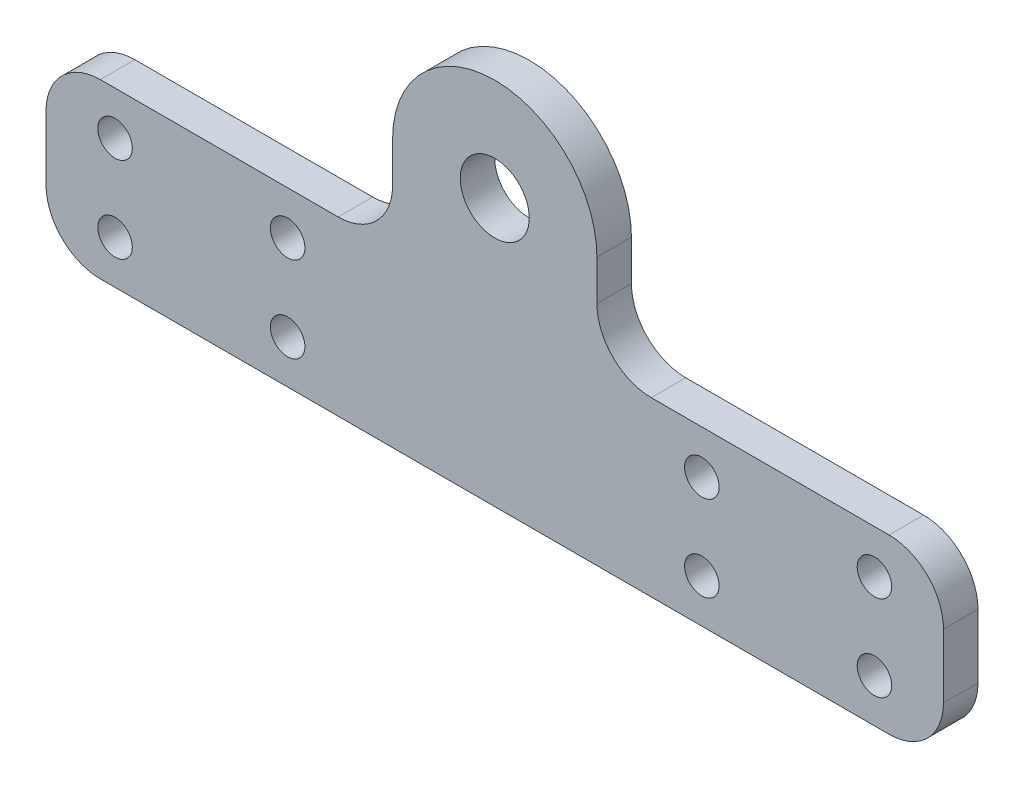
ISO-10303-21;
HEADER;
FILE_DESCRIPTION(('STEP AP214'),'2;1');
FILE_NAME('part.step','',(''),(''),'','','');
FILE_SCHEMA(('AUTOMOTIVE_DESIGN { 1 0 10303 214 1 1 1 1 }'));
ENDSEC;
DATA;
#1=APPLICATION_CONTEXT('core data for automotive mechanical design processes');
#2=APPLICATION_PROTOCOL_DEFINITION('international standard','automotive_design',2000,#1);
#3=PRODUCT_CONTEXT('',#1,'mechanical');
#4=PRODUCT('Part','Part','',(#3));
#5=PRODUCT_RELATED_PRODUCT_CATEGORY('part','',(#4));
#6=PRODUCT_DEFINITION_FORMATION('','',#4);
#7=PRODUCT_DEFINITION_CONTEXT('part definition',#1,'design');
#8=PRODUCT_DEFINITION('design','',#6,#7);
#9=PRODUCT_DEFINITION_SHAPE('','',#8);
#10=(LENGTH_UNIT() NAMED_UNIT(*) SI_UNIT(.MILLI.,.METRE.));
#11=(NAMED_UNIT(*) PLANE_ANGLE_UNIT() SI_UNIT($,.RADIAN.));
#12=(NAMED_UNIT(*) SI_UNIT($,.STERADIAN.) SOLID_ANGLE_UNIT());
#13=UNCERTAINTY_MEASURE_WITH_UNIT(LENGTH_MEASURE(1.E-05),#10,'distance_accuracy_value','');
#14=(GEOMETRIC_REPRESENTATION_CONTEXT(3) GLOBAL_UNCERTAINTY_ASSIGNED_CONTEXT((#13)) GLOBAL_UNIT_ASSIGNED_CONTEXT((#10,
#11,#12)) REPRESENTATION_CONTEXT('',''));
#15=CARTESIAN_POINT('',(0.,0.,0.));
#16=DIRECTION('',(0.,0.,1.));
#17=DIRECTION('',(1.,0.,0.));
#18=AXIS2_PLACEMENT_3D('',#15,#16,#17);
#19=CARTESIAN_POINT('',(14.398,-3.7,3.175));
#20=DIRECTION('',(0.,0.,-1.));
#21=DIRECTION('',(-1.,0.,0.));
#22=AXIS2_PLACEMENT_3D('',#19,#20,#21);
#23=PLANE('',#22);
#24=DIRECTION('',(1.,0.,0.));
#25=VECTOR('',#24,1.);
#26=CARTESIAN_POINT('',(-41.275,-24.575,3.175));
#27=LINE('',#26,#25);
#28=CARTESIAN_POINT('',(-36.275,-24.575,3.175));
#29=VERTEX_POINT('',#28);
#30=CARTESIAN_POINT('',(36.275,-24.575,3.175));
#31=VERTEX_POINT('',#30);
#32=EDGE_CURVE('E246',#29,#31,#27,.T.);
#33=ORIENTED_EDGE('',*,*,#32,.T.);
#34=CARTESIAN_POINT('',(36.275,-19.575,3.175));
#35=DIRECTION('',(0.,0.,-1.));
#36=DIRECTION('',(-1.,0.,0.));
#37=AXIS2_PLACEMENT_3D('',#34,#35,#36);
#38=CIRCLE('',#37,5.);
#39=CARTESIAN_POINT('',(41.275,-19.575,3.175));
#40=VERTEX_POINT('',#39);
#41=EDGE_CURVE('E229',#31,#40,#38,.F.);
#42=ORIENTED_EDGE('',*,*,#41,.T.);
#43=DIRECTION('',(0.,1.,0.));
#44=VECTOR('',#43,1.);
#45=CARTESIAN_POINT('',(41.275,-8.7,3.175));
#46=LINE('',#45,#44);
#47=CARTESIAN_POINT('',(41.275,-13.7,3.175));
#48=VERTEX_POINT('',#47);
#49=EDGE_CURVE('E142',#40,#48,#46,.T.);
#50=ORIENTED_EDGE('',*,*,#49,.T.);
#51=CARTESIAN_POINT('',(36.275,-13.7,3.175));
#52=DIRECTION('',(0.,0.,-1.));
#53=DIRECTION('',(-1.,0.,0.));
#54=AXIS2_PLACEMENT_3D('',#51,#52,#53);
#55=CIRCLE('',#54,5.);
#56=CARTESIAN_POINT('',(36.275,-8.7,3.175));
#57=VERTEX_POINT('',#56);
#58=EDGE_CURVE('E54',#48,#57,#55,.F.);
#59=ORIENTED_EDGE('',*,*,#58,.T.);
#60=DIRECTION('',(-1.,0.,0.));
#61=VECTOR('',#60,1.);
#62=CARTESIAN_POINT('',(14.398,-8.7,3.175));
#63=LINE('',#62,#61);
#64=CARTESIAN_POINT('',(14.398,-8.7,3.175));
#65=VERTEX_POINT('',#64);
#66=EDGE_CURVE('E132',#57,#65,#63,.T.);
#67=ORIENTED_EDGE('',*,*,#66,.T.);
#68=CARTESIAN_POINT('',(14.398,-3.7,3.175));
#69=DIRECTION('',(0.,0.,-1.));
#70=DIRECTION('',(-1.,0.,0.));
#71=AXIS2_PLACEMENT_3D('',#68,#69,#70);
#72=CIRCLE('',#71,5.);
#73=CARTESIAN_POINT('',(9.398,-3.7,3.175));
#74=VERTEX_POINT('',#73);
#75=EDGE_CURVE('E137',#65,#74,#72,.T.);
#76=ORIENTED_EDGE('',*,*,#75,.T.);
#77=DIRECTION('',(0.,1.,0.));
#78=VECTOR('',#77,1.);
#79=CARTESIAN_POINT('',(9.398,-3.7,3.175));
#80=LINE('',#79,#78);
#81=CARTESIAN_POINT('',(9.398,0.,3.175));
#82=VERTEX_POINT('',#81);
#83=EDGE_CURVE('E157',#74,#82,#80,.T.);
#84=ORIENTED_EDGE('',*,*,#83,.T.);
#85=CARTESIAN_POINT('',(0.,0.,3.175));
#86=DIRECTION('',(0.,0.,1.));
#87=DIRECTION('',(-1.,0.,0.));
#88=AXIS2_PLACEMENT_3D('',#85,#86,#87);
#89=CIRCLE('',#88,9.398);
#90=CARTESIAN_POINT('',(-9.398,0.,3.175));
#91=VERTEX_POINT('',#90);
#92=EDGE_CURVE('E159',#82,#91,#89,.T.);
#93=ORIENTED_EDGE('',*,*,#92,.T.);
#94=DIRECTION('',(0.,-1.,0.));
#95=VECTOR('',#94,1.);
#96=CARTESIAN_POINT('',(-9.398,-3.7,3.175));
#97=LINE('',#96,#95);
#98=CARTESIAN_POINT('',(-9.398,-3.7,3.175));
#99=VERTEX_POINT('',#98);
#100=EDGE_CURVE('E164',#91,#99,#97,.T.);
#101=ORIENTED_EDGE('',*,*,#100,.T.);
#102=CARTESIAN_POINT('',(-14.398,-3.7,3.175));
#103=DIRECTION('',(0.,0.,-1.));
#104=DIRECTION('',(1.,0.,0.));
#105=AXIS2_PLACEMENT_3D('',#102,#103,#104);
#106=CIRCLE('',#105,5.);
#107=CARTESIAN_POINT('',(-14.398,-8.7,3.175));
#108=VERTEX_POINT('',#107);
#109=EDGE_CURVE('E166',#99,#108,#106,.T.);
#110=ORIENTED_EDGE('',*,*,#109,.T.);
#111=DIRECTION('',(-1.,0.,0.));
#112=VECTOR('',#111,1.);
#113=CARTESIAN_POINT('',(-41.275,-8.7,3.175));
#114=LINE('',#113,#112);
#115=CARTESIAN_POINT('',(-36.275,-8.7,3.175));
#116=VERTEX_POINT('',#115);
#117=EDGE_CURVE('E168',#108,#116,#114,.T.);
#118=ORIENTED_EDGE('',*,*,#117,.T.);
#119=CARTESIAN_POINT('',(-36.275,-13.7,3.175));
#120=DIRECTION('',(0.,0.,-1.));
#121=DIRECTION('',(-1.,0.,0.));
#122=AXIS2_PLACEMENT_3D('',#119,#120,#121);
#123=CIRCLE('',#122,5.);
#124=CARTESIAN_POINT('',(-41.275,-13.7,3.175));
#125=VERTEX_POINT('',#124);
#126=EDGE_CURVE('E224',#116,#125,#123,.F.);
#127=ORIENTED_EDGE('',*,*,#126,.T.);
#128=DIRECTION('',(0.,-1.,0.));
#129=VECTOR('',#128,1.);
#130=CARTESIAN_POINT('',(-41.275,-8.7,3.175));
#131=LINE('',#130,#129);
#132=CARTESIAN_POINT('',(-41.275,-19.575,3.175));
#133=VERTEX_POINT('',#132);
#134=EDGE_CURVE('E194',#125,#133,#131,.T.);
#135=ORIENTED_EDGE('',*,*,#134,.T.);
#136=CARTESIAN_POINT('',(-36.275,-19.575,3.175));
#137=DIRECTION('',(0.,0.,-1.));
#138=DIRECTION('',(-1.,0.,0.));
#139=AXIS2_PLACEMENT_3D('',#136,#137,#138);
#140=CIRCLE('',#139,5.);
#141=EDGE_CURVE('E226',#133,#29,#140,.F.);
#142=ORIENTED_EDGE('',*,*,#141,.T.);
#143=EDGE_LOOP('',(#33,#42,#50,#59,#67,#76,#84,#93,#101,#110,#118,#127,#135,#142));
#144=FACE_BOUND('',#143,.T.);
#145=CARTESIAN_POINT('',(0.,0.,3.175));
#146=DIRECTION('',(0.,0.,1.));
#147=DIRECTION('',(1.,0.,0.));
#148=AXIS2_PLACEMENT_3D('',#145,#146,#147);
#149=CIRCLE('',#148,3.175);
#150=CARTESIAN_POINT('',(3.175,0.,3.175));
#151=VERTEX_POINT('',#150);
#152=EDGE_CURVE('E175',#151,#151,#149,.T.);
#153=ORIENTED_EDGE('',*,*,#152,.F.);
#154=EDGE_LOOP('',(#153));
#155=FACE_BOUND('',#154,.T.);
#156=CARTESIAN_POINT('',(-34.925,-12.7,3.175));
#157=DIRECTION('',(0.,0.,1.));
#158=DIRECTION('',(1.,0.,0.));
#159=AXIS2_PLACEMENT_3D('',#156,#157,#158);
#160=CIRCLE('',#159,1.5875);
#161=CARTESIAN_POINT('',(-33.3375,-12.7,3.175));
#162=VERTEX_POINT('',#161);
#163=EDGE_CURVE('E271',#162,#162,#160,.T.);
#164=ORIENTED_EDGE('',*,*,#163,.F.);
#165=EDGE_LOOP('',(#164));
#166=FACE_BOUND('',#165,.T.);
#167=CARTESIAN_POINT('',(-34.925,-20.575,3.175));
#168=DIRECTION('',(0.,0.,1.));
#169=DIRECTION('',(1.,0.,0.));
#170=AXIS2_PLACEMENT_3D('',#167,#168,#169);
#171=CIRCLE('',#170,1.5875);
#172=CARTESIAN_POINT('',(-33.3375,-20.575,3.175));
#173=VERTEX_POINT('',#172);
#174=EDGE_CURVE('E277',#173,#173,#171,.T.);
#175=ORIENTED_EDGE('',*,*,#174,.F.);
#176=EDGE_LOOP('',(#175));
#177=FACE_BOUND('',#176,.T.);
#178=CARTESIAN_POINT('',(-19.05,-12.7,3.175));
#179=DIRECTION('',(0.,0.,1.));
#180=DIRECTION('',(1.,0.,0.));
#181=AXIS2_PLACEMENT_3D('',#178,#179,#180);
#182=CIRCLE('',#181,1.5875);
#183=CARTESIAN_POINT('',(-17.4625,-12.7,3.175));
#184=VERTEX_POINT('',#183);
#185=EDGE_CURVE('E283',#184,#184,#182,.T.);
#186=ORIENTED_EDGE('',*,*,#185,.F.);
#187=EDGE_LOOP('',(#186));
#188=FACE_BOUND('',#187,.T.);
#189=CARTESIAN_POINT('',(-19.05,-20.575,3.175));
#190=DIRECTION('',(0.,0.,1.));
#191=DIRECTION('',(1.,0.,0.));
#192=AXIS2_PLACEMENT_3D('',#189,#190,#191);
#193=CIRCLE('',#192,1.5875);
#194=CARTESIAN_POINT('',(-17.4625,-20.575,3.175));
#195=VERTEX_POINT('',#194);
#196=EDGE_CURVE('E289',#195,#195,#193,.T.);
#197=ORIENTED_EDGE('',*,*,#196,.F.);
#198=EDGE_LOOP('',(#197));
#199=FACE_BOUND('',#198,.T.);
#200=CARTESIAN_POINT('',(19.05,-20.575,3.175));
#201=DIRECTION('',(0.,0.,1.));
#202=DIRECTION('',(-1.,0.,0.));
#203=AXIS2_PLACEMENT_3D('',#200,#201,#202);
#204=CIRCLE('',#203,1.5875);
#205=CARTESIAN_POINT('',(17.4625,-20.575,3.175));
#206=VERTEX_POINT('',#205);
#207=EDGE_CURVE('E295',#206,#206,#204,.T.);
#208=ORIENTED_EDGE('',*,*,#207,.F.);
#209=EDGE_LOOP('',(#208));
#210=FACE_BOUND('',#209,.T.);
#211=CARTESIAN_POINT('',(19.05,-12.7,3.175));
#212=DIRECTION('',(0.,0.,1.));
#213=DIRECTION('',(-1.,0.,0.));
#214=AXIS2_PLACEMENT_3D('',#211,#212,#213);
#215=CIRCLE('',#214,1.5875);
#216=CARTESIAN_POINT('',(17.4625,-12.7,3.175));
#217=VERTEX_POINT('',#216);
#218=EDGE_CURVE('E301',#217,#217,#215,.T.);
#219=ORIENTED_EDGE('',*,*,#218,.F.);
#220=EDGE_LOOP('',(#219));
#221=FACE_BOUND('',#220,.T.);
#222=CARTESIAN_POINT('',(34.925,-20.575,3.175));
#223=DIRECTION('',(0.,0.,1.));
#224=DIRECTION('',(-1.,0.,0.));
#225=AXIS2_PLACEMENT_3D('',#222,#223,#224);
#226=CIRCLE('',#225,1.5875);
#227=CARTESIAN_POINT('',(33.3375,-20.575,3.175));
#228=VERTEX_POINT('',#227);
#229=EDGE_CURVE('E307',#228,#228,#226,.T.);
#230=ORIENTED_EDGE('',*,*,#229,.F.);
#231=EDGE_LOOP('',(#230));
#232=FACE_BOUND('',#231,.T.);
#233=CARTESIAN_POINT('',(34.925,-12.7,3.175));
#234=DIRECTION('',(0.,0.,1.));
#235=DIRECTION('',(-1.,0.,0.));
#236=AXIS2_PLACEMENT_3D('',#233,#234,#235);
#237=CIRCLE('',#236,1.5875);
#238=CARTESIAN_POINT('',(33.3375,-12.7,3.175));
#239=VERTEX_POINT('',#238);
#240=EDGE_CURVE('E313',#239,#239,#237,.T.);
#241=ORIENTED_EDGE('',*,*,#240,.F.);
#242=EDGE_LOOP('',(#241));
#243=FACE_BOUND('',#242,.T.);
#244=ADVANCED_FACE('F33',(#144,#155,#166,#177,#188,#199,#210,#221,#232,#243),#23,.F.);
#245=CARTESIAN_POINT('',(14.398,-3.7,0.));
#246=DIRECTION('',(0.,0.,-1.));
#247=DIRECTION('',(-1.,0.,0.));
#248=AXIS2_PLACEMENT_3D('',#245,#246,#247);
#249=PLANE('',#248);
#250=CARTESIAN_POINT('',(34.925,-20.575,0.));
#251=DIRECTION('',(0.,0.,1.));
#252=DIRECTION('',(-1.,0.,0.));
#253=AXIS2_PLACEMENT_3D('',#250,#251,#252);
#254=CIRCLE('',#253,1.5875);
#255=CARTESIAN_POINT('',(33.3375,-20.575,0.));
#256=VERTEX_POINT('',#255);
#257=EDGE_CURVE('E310',#256,#256,#254,.T.);
#258=ORIENTED_EDGE('',*,*,#257,.T.);
#259=EDGE_LOOP('',(#258));
#260=FACE_BOUND('',#259,.T.);
#261=CARTESIAN_POINT('',(19.05,-20.575,0.));
#262=DIRECTION('',(0.,0.,1.));
#263=DIRECTION('',(-1.,0.,0.));
#264=AXIS2_PLACEMENT_3D('',#261,#262,#263);
#265=CIRCLE('',#264,1.5875);
#266=CARTESIAN_POINT('',(17.4625,-20.575,0.));
#267=VERTEX_POINT('',#266);
#268=EDGE_CURVE('E298',#267,#267,#265,.T.);
#269=ORIENTED_EDGE('',*,*,#268,.T.);
#270=EDGE_LOOP('',(#269));
#271=FACE_BOUND('',#270,.T.);
#272=CARTESIAN_POINT('',(-19.05,-12.7,0.));
#273=DIRECTION('',(0.,0.,1.));
#274=DIRECTION('',(1.,0.,0.));
#275=AXIS2_PLACEMENT_3D('',#272,#273,#274);
#276=CIRCLE('',#275,1.5875);
#277=CARTESIAN_POINT('',(-17.4625,-12.7,0.));
#278=VERTEX_POINT('',#277);
#279=EDGE_CURVE('E286',#278,#278,#276,.T.);
#280=ORIENTED_EDGE('',*,*,#279,.T.);
#281=EDGE_LOOP('',(#280));
#282=FACE_BOUND('',#281,.T.);
#283=CARTESIAN_POINT('',(-34.925,-12.7,0.));
#284=DIRECTION('',(0.,0.,1.));
#285=DIRECTION('',(1.,0.,0.));
#286=AXIS2_PLACEMENT_3D('',#283,#284,#285);
#287=CIRCLE('',#286,1.5875);
#288=CARTESIAN_POINT('',(-33.3375,-12.7,0.));
#289=VERTEX_POINT('',#288);
#290=EDGE_CURVE('E274',#289,#289,#287,.T.);
#291=ORIENTED_EDGE('',*,*,#290,.T.);
#292=EDGE_LOOP('',(#291));
#293=FACE_BOUND('',#292,.T.);
#294=DIRECTION('',(0.,1.,0.));
#295=VECTOR('',#294,1.);
#296=CARTESIAN_POINT('',(41.275,-8.7,0.));
#297=LINE('',#296,#295);
#298=CARTESIAN_POINT('',(41.275,-19.575,0.));
#299=VERTEX_POINT('',#298);
#300=CARTESIAN_POINT('',(41.275,-13.7,0.));
#301=VERTEX_POINT('',#300);
#302=EDGE_CURVE('E178',#299,#301,#297,.T.);
#303=ORIENTED_EDGE('',*,*,#302,.F.);
#304=CARTESIAN_POINT('',(36.275,-19.575,0.));
#305=DIRECTION('',(0.,0.,-1.));
#306=DIRECTION('',(-1.,0.,0.));
#307=AXIS2_PLACEMENT_3D('',#304,#305,#306);
#308=CIRCLE('',#307,5.);
#309=CARTESIAN_POINT('',(36.275,-24.575,0.));
#310=VERTEX_POINT('',#309);
#311=EDGE_CURVE('E217',#299,#310,#308,.T.);
#312=ORIENTED_EDGE('',*,*,#311,.T.);
#313=DIRECTION('',(1.,0.,0.));
#314=VECTOR('',#313,1.);
#315=CARTESIAN_POINT('',(-41.275,-24.575,0.));
#316=LINE('',#315,#314);
#317=CARTESIAN_POINT('',(-36.275,-24.575,0.));
#318=VERTEX_POINT('',#317);
#319=EDGE_CURVE('E174',#318,#310,#316,.T.);
#320=ORIENTED_EDGE('',*,*,#319,.F.);
#321=CARTESIAN_POINT('',(-36.275,-19.575,0.));
#322=DIRECTION('',(0.,0.,-1.));
#323=DIRECTION('',(-1.,0.,0.));
#324=AXIS2_PLACEMENT_3D('',#321,#322,#323);
#325=CIRCLE('',#324,5.);
#326=CARTESIAN_POINT('',(-41.275,-19.575,0.));
#327=VERTEX_POINT('',#326);
#328=EDGE_CURVE('E213',#318,#327,#325,.T.);
#329=ORIENTED_EDGE('',*,*,#328,.T.);
#330=DIRECTION('',(0.,-1.,0.));
#331=VECTOR('',#330,1.);
#332=CARTESIAN_POINT('',(-41.275,-8.7,0.));
#333=LINE('',#332,#331);
#334=CARTESIAN_POINT('',(-41.275,-13.7,0.));
#335=VERTEX_POINT('',#334);
#336=EDGE_CURVE('E171',#335,#327,#333,.T.);
#337=ORIENTED_EDGE('',*,*,#336,.F.);
#338=CARTESIAN_POINT('',(-36.275,-13.7,0.));
#339=DIRECTION('',(0.,0.,-1.));
#340=DIRECTION('',(-1.,0.,0.));
#341=AXIS2_PLACEMENT_3D('',#338,#339,#340);
#342=CIRCLE('',#341,5.);
#343=CARTESIAN_POINT('',(-36.275,-8.7,0.));
#344=VERTEX_POINT('',#343);
#345=EDGE_CURVE('E211',#335,#344,#342,.T.);
#346=ORIENTED_EDGE('',*,*,#345,.T.);
#347=DIRECTION('',(-1.,0.,0.));
#348=VECTOR('',#347,1.);
#349=CARTESIAN_POINT('',(-41.275,-8.7,0.));
#350=LINE('',#349,#348);
#351=CARTESIAN_POINT('',(-14.398,-8.7,0.));
#352=VERTEX_POINT('',#351);
#353=EDGE_CURVE('E192',#352,#344,#350,.T.);
#354=ORIENTED_EDGE('',*,*,#353,.F.);
#355=CARTESIAN_POINT('',(-14.398,-3.7,0.));
#356=DIRECTION('',(0.,0.,-1.));
#357=DIRECTION('',(1.,0.,0.));
#358=AXIS2_PLACEMENT_3D('',#355,#356,#357);
#359=CIRCLE('',#358,5.);
#360=CARTESIAN_POINT('',(-9.398,-3.7,0.));
#361=VERTEX_POINT('',#360);
#362=EDGE_CURVE('E190',#361,#352,#359,.T.);
#363=ORIENTED_EDGE('',*,*,#362,.F.);
#364=DIRECTION('',(0.,-1.,0.));
#365=VECTOR('',#364,1.);
#366=CARTESIAN_POINT('',(-9.398,-3.7,0.));
#367=LINE('',#366,#365);
#368=CARTESIAN_POINT('',(-9.398,0.,0.));
#369=VERTEX_POINT('',#368);
#370=EDGE_CURVE('E188',#369,#361,#367,.T.);
#371=ORIENTED_EDGE('',*,*,#370,.F.);
#372=CARTESIAN_POINT('',(0.,0.,0.));
#373=DIRECTION('',(0.,0.,1.));
#374=DIRECTION('',(-1.,0.,0.));
#375=AXIS2_PLACEMENT_3D('',#372,#373,#374);
#376=CIRCLE('',#375,9.398);
#377=CARTESIAN_POINT('',(9.398,0.,0.));
#378=VERTEX_POINT('',#377);
#379=EDGE_CURVE('E186',#378,#369,#376,.T.);
#380=ORIENTED_EDGE('',*,*,#379,.F.);
#381=DIRECTION('',(0.,1.,0.));
#382=VECTOR('',#381,1.);
#383=CARTESIAN_POINT('',(9.398,-3.7,0.));
#384=LINE('',#383,#382);
#385=CARTESIAN_POINT('',(9.398,-3.7,0.));
#386=VERTEX_POINT('',#385);
#387=EDGE_CURVE('E184',#386,#378,#384,.T.);
#388=ORIENTED_EDGE('',*,*,#387,.F.);
#389=CARTESIAN_POINT('',(14.398,-3.7,0.));
#390=DIRECTION('',(0.,0.,-1.));
#391=DIRECTION('',(-1.,0.,0.));
#392=AXIS2_PLACEMENT_3D('',#389,#390,#391);
#393=CIRCLE('',#392,5.);
#394=CARTESIAN_POINT('',(14.398,-8.7,0.));
#395=VERTEX_POINT('',#394);
#396=EDGE_CURVE('E182',#395,#386,#393,.T.);
#397=ORIENTED_EDGE('',*,*,#396,.F.);
#398=DIRECTION('',(-1.,0.,0.));
#399=VECTOR('',#398,1.);
#400=CARTESIAN_POINT('',(14.398,-8.7,0.));
#401=LINE('',#400,#399);
#402=CARTESIAN_POINT('',(36.275,-8.7,0.));
#403=VERTEX_POINT('',#402);
#404=EDGE_CURVE('E148',#403,#395,#401,.T.);
#405=ORIENTED_EDGE('',*,*,#404,.F.);
#406=CARTESIAN_POINT('',(36.275,-13.7,0.));
#407=DIRECTION('',(0.,0.,-1.));
#408=DIRECTION('',(-1.,0.,0.));
#409=AXIS2_PLACEMENT_3D('',#406,#407,#408);
#410=CIRCLE('',#409,5.);
#411=EDGE_CURVE('E215',#403,#301,#410,.T.);
#412=ORIENTED_EDGE('',*,*,#411,.T.);
#413=EDGE_LOOP('',(#303,#312,#320,#329,#337,#346,#354,#363,#371,#380,#388,#397,#405,#412));
#414=FACE_BOUND('',#413,.T.);
#415=CARTESIAN_POINT('',(0.,0.,0.));
#416=DIRECTION('',(0.,0.,1.));
#417=DIRECTION('',(1.,0.,0.));
#418=AXIS2_PLACEMENT_3D('',#415,#416,#417);
#419=CIRCLE('',#418,3.175);
#420=CARTESIAN_POINT('',(3.175,0.,0.));
#421=VERTEX_POINT('',#420);
#422=EDGE_CURVE('E268',#421,#421,#419,.T.);
#423=ORIENTED_EDGE('',*,*,#422,.T.);
#424=EDGE_LOOP('',(#423));
#425=FACE_BOUND('',#424,.T.);
#426=CARTESIAN_POINT('',(-34.925,-20.575,0.));
#427=DIRECTION('',(0.,0.,1.));
#428=DIRECTION('',(1.,0.,0.));
#429=AXIS2_PLACEMENT_3D('',#426,#427,#428);
#430=CIRCLE('',#429,1.5875);
#431=CARTESIAN_POINT('',(-33.3375,-20.575,0.));
#432=VERTEX_POINT('',#431);
#433=EDGE_CURVE('E280',#432,#432,#430,.T.);
#434=ORIENTED_EDGE('',*,*,#433,.T.);
#435=EDGE_LOOP('',(#434));
#436=FACE_BOUND('',#435,.T.);
#437=CARTESIAN_POINT('',(-19.05,-20.575,0.));
#438=DIRECTION('',(0.,0.,1.));
#439=DIRECTION('',(1.,0.,0.));
#440=AXIS2_PLACEMENT_3D('',#437,#438,#439);
#441=CIRCLE('',#440,1.5875);
#442=CARTESIAN_POINT('',(-17.4625,-20.575,0.));
#443=VERTEX_POINT('',#442);
#444=EDGE_CURVE('E292',#443,#443,#441,.T.);
#445=ORIENTED_EDGE('',*,*,#444,.T.);
#446=EDGE_LOOP('',(#445));
#447=FACE_BOUND('',#446,.T.);
#448=CARTESIAN_POINT('',(19.05,-12.7,0.));
#449=DIRECTION('',(0.,0.,1.));
#450=DIRECTION('',(-1.,0.,0.));
#451=AXIS2_PLACEMENT_3D('',#448,#449,#450);
#452=CIRCLE('',#451,1.5875);
#453=CARTESIAN_POINT('',(17.4625,-12.7,0.));
#454=VERTEX_POINT('',#453);
#455=EDGE_CURVE('E304',#454,#454,#452,.T.);
#456=ORIENTED_EDGE('',*,*,#455,.T.);
#457=EDGE_LOOP('',(#456));
#458=FACE_BOUND('',#457,.T.);
#459=CARTESIAN_POINT('',(34.925,-12.7,0.));
#460=DIRECTION('',(0.,0.,1.));
#461=DIRECTION('',(-1.,0.,0.));
#462=AXIS2_PLACEMENT_3D('',#459,#460,#461);
#463=CIRCLE('',#462,1.5875);
#464=CARTESIAN_POINT('',(33.3375,-12.7,0.));
#465=VERTEX_POINT('',#464);
#466=EDGE_CURVE('E316',#465,#465,#463,.T.);
#467=ORIENTED_EDGE('',*,*,#466,.T.);
#468=EDGE_LOOP('',(#467));
#469=FACE_BOUND('',#468,.T.);
#470=ADVANCED_FACE('F256',(#260,#271,#282,#293,#414,#425,#436,#447,#458,#469),#249,.T.);
#471=CARTESIAN_POINT('',(-41.275,-8.7,3.175));
#472=DIRECTION('',(1.,0.,0.));
#473=DIRECTION('',(0.,0.,-1.));
#474=AXIS2_PLACEMENT_3D('',#471,#472,#473);
#475=PLANE('',#474);
#476=ORIENTED_EDGE('',*,*,#336,.T.);
#477=DIRECTION('',(0.,0.,-1.));
#478=VECTOR('',#477,1.);
#479=CARTESIAN_POINT('',(-41.275,-19.575,3.175));
#480=LINE('',#479,#478);
#481=EDGE_CURVE('E41',#327,#133,#480,.F.);
#482=ORIENTED_EDGE('',*,*,#481,.T.);
#483=ORIENTED_EDGE('',*,*,#134,.F.);
#484=DIRECTION('',(0.,0.,-1.));
#485=VECTOR('',#484,1.);
#486=CARTESIAN_POINT('',(-41.275,-13.7,3.175));
#487=LINE('',#486,#485);
#488=EDGE_CURVE('E233',#125,#335,#487,.T.);
#489=ORIENTED_EDGE('',*,*,#488,.T.);
#490=EDGE_LOOP('',(#476,#482,#483,#489));
#491=FACE_BOUND('',#490,.T.);
#492=ADVANCED_FACE('F239',(#491),#475,.F.);
#493=CARTESIAN_POINT('',(-41.275,-24.575,3.175));
#494=DIRECTION('',(0.,1.,0.));
#495=DIRECTION('',(0.,0.,1.));
#496=AXIS2_PLACEMENT_3D('',#493,#494,#495);
#497=PLANE('',#496);
#498=ORIENTED_EDGE('',*,*,#319,.T.);
#499=DIRECTION('',(0.,0.,-1.));
#500=VECTOR('',#499,1.);
#501=CARTESIAN_POINT('',(36.275,-24.575,3.175));
#502=LINE('',#501,#500);
#503=EDGE_CURVE('E222',#310,#31,#502,.F.);
#504=ORIENTED_EDGE('',*,*,#503,.T.);
#505=ORIENTED_EDGE('',*,*,#32,.F.);
#506=DIRECTION('',(0.,0.,-1.));
#507=VECTOR('',#506,1.);
#508=CARTESIAN_POINT('',(-36.275,-24.575,3.175));
#509=LINE('',#508,#507);
#510=EDGE_CURVE('E219',#29,#318,#509,.T.);
#511=ORIENTED_EDGE('',*,*,#510,.T.);
#512=EDGE_LOOP('',(#498,#504,#505,#511));
#513=FACE_BOUND('',#512,.T.);
#514=ADVANCED_FACE('F252',(#513),#497,.F.);
#515=CARTESIAN_POINT('',(41.275,-8.7,3.175));
#516=DIRECTION('',(-1.,0.,0.));
#517=DIRECTION('',(0.,0.,1.));
#518=AXIS2_PLACEMENT_3D('',#515,#516,#517);
#519=PLANE('',#518);
#520=ORIENTED_EDGE('',*,*,#49,.F.);
#521=DIRECTION('',(0.,0.,-1.));
#522=VECTOR('',#521,1.);
#523=CARTESIAN_POINT('',(41.275,-19.575,3.175));
#524=LINE('',#523,#522);
#525=EDGE_CURVE('E208',#40,#299,#524,.T.);
#526=ORIENTED_EDGE('',*,*,#525,.T.);
#527=ORIENTED_EDGE('',*,*,#302,.T.);
#528=DIRECTION('',(0.,0.,-1.));
#529=VECTOR('',#528,1.);
#530=CARTESIAN_POINT('',(41.275,-13.7,3.175));
#531=LINE('',#530,#529);
#532=EDGE_CURVE('E151',#301,#48,#531,.F.);
#533=ORIENTED_EDGE('',*,*,#532,.T.);
#534=EDGE_LOOP('',(#520,#526,#527,#533));
#535=FACE_BOUND('',#534,.T.);
#536=ADVANCED_FACE('F264',(#535),#519,.F.);
#537=CARTESIAN_POINT('',(14.398,-8.7,3.175));
#538=DIRECTION('',(0.,-1.,0.));
#539=DIRECTION('',(0.,0.,-1.));
#540=AXIS2_PLACEMENT_3D('',#537,#538,#539);
#541=PLANE('',#540);
#542=ORIENTED_EDGE('',*,*,#66,.F.);
#543=DIRECTION('',(0.,0.,-1.));
#544=VECTOR('',#543,1.);
#545=CARTESIAN_POINT('',(36.275,-8.7,3.175));
#546=LINE('',#545,#544);
#547=EDGE_CURVE('E231',#57,#403,#546,.T.);
#548=ORIENTED_EDGE('',*,*,#547,.T.);
#549=ORIENTED_EDGE('',*,*,#404,.T.);
#550=DIRECTION('',(0.,0.,-1.));
#551=VECTOR('',#550,1.);
#552=CARTESIAN_POINT('',(14.398,-8.7,3.175));
#553=LINE('',#552,#551);
#554=EDGE_CURVE('E145',#65,#395,#553,.T.);
#555=ORIENTED_EDGE('',*,*,#554,.F.);
#556=EDGE_LOOP('',(#542,#548,#549,#555));
#557=FACE_BOUND('',#556,.T.);
#558=ADVANCED_FACE('F146',(#557),#541,.F.);
#559=CARTESIAN_POINT('',(14.398,-3.7,3.175));
#560=DIRECTION('',(0.,0.,-1.));
#561=DIRECTION('',(-1.,0.,0.));
#562=AXIS2_PLACEMENT_3D('',#559,#560,#561);
#563=CYLINDRICAL_SURFACE('',#562,5.);
#564=ORIENTED_EDGE('',*,*,#396,.T.);
#565=DIRECTION('',(0.,0.,-1.));
#566=VECTOR('',#565,1.);
#567=CARTESIAN_POINT('',(9.398,-3.7,3.175));
#568=LINE('',#567,#566);
#569=EDGE_CURVE('E152',#74,#386,#568,.T.);
#570=ORIENTED_EDGE('',*,*,#569,.F.);
#571=ORIENTED_EDGE('',*,*,#75,.F.);
#572=ORIENTED_EDGE('',*,*,#554,.T.);
#573=EDGE_LOOP('',(#564,#570,#571,#572));
#574=FACE_BOUND('',#573,.T.);
#575=ADVANCED_FACE('F154',(#574),#563,.F.);
#576=CARTESIAN_POINT('',(9.398,-3.7,3.175));
#577=DIRECTION('',(-1.,0.,0.));
#578=DIRECTION('',(0.,0.,1.));
#579=AXIS2_PLACEMENT_3D('',#576,#577,#578);
#580=PLANE('',#579);
#581=ORIENTED_EDGE('',*,*,#387,.T.);
#582=DIRECTION('',(0.,0.,-1.));
#583=VECTOR('',#582,1.);
#584=CARTESIAN_POINT('',(9.398,0.,3.175));
#585=LINE('',#584,#583);
#586=EDGE_CURVE('E203',#82,#378,#585,.T.);
#587=ORIENTED_EDGE('',*,*,#586,.F.);
#588=ORIENTED_EDGE('',*,*,#83,.F.);
#589=ORIENTED_EDGE('',*,*,#569,.T.);
#590=EDGE_LOOP('',(#581,#587,#588,#589));
#591=FACE_BOUND('',#590,.T.);
#592=ADVANCED_FACE('F350',(#591),#580,.F.);
#593=CARTESIAN_POINT('',(0.,0.,3.175));
#594=DIRECTION('',(0.,0.,-1.));
#595=DIRECTION('',(-1.,0.,0.));
#596=AXIS2_PLACEMENT_3D('',#593,#594,#595);
#597=CYLINDRICAL_SURFACE('',#596,9.398);
#598=ORIENTED_EDGE('',*,*,#379,.T.);
#599=DIRECTION('',(0.,0.,-1.));
#600=VECTOR('',#599,1.);
#601=CARTESIAN_POINT('',(-9.398,0.,3.175));
#602=LINE('',#601,#600);
#603=EDGE_CURVE('E200',#91,#369,#602,.T.);
#604=ORIENTED_EDGE('',*,*,#603,.F.);
#605=ORIENTED_EDGE('',*,*,#92,.F.);
#606=ORIENTED_EDGE('',*,*,#586,.T.);
#607=EDGE_LOOP('',(#598,#604,#605,#606));
#608=FACE_BOUND('',#607,.T.);
#609=ADVANCED_FACE('F346',(#608),#597,.T.);
#610=CARTESIAN_POINT('',(-9.398,-3.7,3.175));
#611=DIRECTION('',(1.,0.,0.));
#612=DIRECTION('',(0.,0.,-1.));
#613=AXIS2_PLACEMENT_3D('',#610,#611,#612);
#614=PLANE('',#613);
#615=ORIENTED_EDGE('',*,*,#370,.T.);
#616=DIRECTION('',(0.,0.,-1.));
#617=VECTOR('',#616,1.);
#618=CARTESIAN_POINT('',(-9.398,-3.7,3.175));
#619=LINE('',#618,#617);
#620=EDGE_CURVE('E197',#99,#361,#619,.T.);
#621=ORIENTED_EDGE('',*,*,#620,.F.);
#622=ORIENTED_EDGE('',*,*,#100,.F.);
#623=ORIENTED_EDGE('',*,*,#603,.T.);
#624=EDGE_LOOP('',(#615,#621,#622,#623));
#625=FACE_BOUND('',#624,.T.);
#626=ADVANCED_FACE('F342',(#625),#614,.F.);
#627=CARTESIAN_POINT('',(-14.398,-3.7,3.175));
#628=DIRECTION('',(0.,0.,-1.));
#629=DIRECTION('',(-1.,0.,0.));
#630=AXIS2_PLACEMENT_3D('',#627,#628,#629);
#631=CYLINDRICAL_SURFACE('',#630,5.);
#632=ORIENTED_EDGE('',*,*,#362,.T.);
#633=DIRECTION('',(0.,0.,-1.));
#634=VECTOR('',#633,1.);
#635=CARTESIAN_POINT('',(-14.398,-8.7,3.175));
#636=LINE('',#635,#634);
#637=EDGE_CURVE('E170',#108,#352,#636,.T.);
#638=ORIENTED_EDGE('',*,*,#637,.F.);
#639=ORIENTED_EDGE('',*,*,#109,.F.);
#640=ORIENTED_EDGE('',*,*,#620,.T.);
#641=EDGE_LOOP('',(#632,#638,#639,#640));
#642=FACE_BOUND('',#641,.T.);
#643=ADVANCED_FACE('F339',(#642),#631,.F.);
#644=CARTESIAN_POINT('',(-41.275,-8.7,3.175));
#645=DIRECTION('',(0.,-1.,0.));
#646=DIRECTION('',(0.,0.,-1.));
#647=AXIS2_PLACEMENT_3D('',#644,#645,#646);
#648=PLANE('',#647);
#649=ORIENTED_EDGE('',*,*,#353,.T.);
#650=DIRECTION('',(0.,0.,-1.));
#651=VECTOR('',#650,1.);
#652=CARTESIAN_POINT('',(-36.275,-8.7,3.175));
#653=LINE('',#652,#651);
#654=EDGE_CURVE('E11',#344,#116,#653,.F.);
#655=ORIENTED_EDGE('',*,*,#654,.T.);
#656=ORIENTED_EDGE('',*,*,#117,.F.);
#657=ORIENTED_EDGE('',*,*,#637,.T.);
#658=EDGE_LOOP('',(#649,#655,#656,#657));
#659=FACE_BOUND('',#658,.T.);
#660=ADVANCED_FACE('F336',(#659),#648,.F.);
#661=CARTESIAN_POINT('',(0.,0.,3.175));
#662=DIRECTION('',(0.,0.,-1.));
#663=DIRECTION('',(-1.,0.,0.));
#664=AXIS2_PLACEMENT_3D('',#661,#662,#663);
#665=CYLINDRICAL_SURFACE('',#664,3.175);
#666=ORIENTED_EDGE('',*,*,#152,.T.);
#667=EDGE_LOOP('',(#666));
#668=FACE_BOUND('',#667,.T.);
#669=ORIENTED_EDGE('',*,*,#422,.F.);
#670=EDGE_LOOP('',(#669));
#671=FACE_BOUND('',#670,.T.);
#672=ADVANCED_FACE('F333',(#668,#671),#665,.F.);
#673=CARTESIAN_POINT('',(-34.925,-12.7,3.175));
#674=DIRECTION('',(0.,0.,-1.));
#675=DIRECTION('',(-1.,0.,0.));
#676=AXIS2_PLACEMENT_3D('',#673,#674,#675);
#677=CYLINDRICAL_SURFACE('',#676,1.5875);
#678=ORIENTED_EDGE('',*,*,#163,.T.);
#679=EDGE_LOOP('',(#678));
#680=FACE_BOUND('',#679,.T.);
#681=ORIENTED_EDGE('',*,*,#290,.F.);
#682=EDGE_LOOP('',(#681));
#683=FACE_BOUND('',#682,.T.);
#684=ADVANCED_FACE('F517',(#680,#683),#677,.F.);
#685=CARTESIAN_POINT('',(-34.925,-20.575,3.175));
#686=DIRECTION('',(0.,0.,-1.));
#687=DIRECTION('',(-1.,0.,0.));
#688=AXIS2_PLACEMENT_3D('',#685,#686,#687);
#689=CYLINDRICAL_SURFACE('',#688,1.5875);
#690=ORIENTED_EDGE('',*,*,#174,.T.);
#691=EDGE_LOOP('',(#690));
#692=FACE_BOUND('',#691,.T.);
#693=ORIENTED_EDGE('',*,*,#433,.F.);
#694=EDGE_LOOP('',(#693));
#695=FACE_BOUND('',#694,.T.);
#696=ADVANCED_FACE('F507',(#692,#695),#689,.F.);
#697=CARTESIAN_POINT('',(-19.05,-12.7,3.175));
#698=DIRECTION('',(0.,0.,-1.));
#699=DIRECTION('',(-1.,0.,0.));
#700=AXIS2_PLACEMENT_3D('',#697,#698,#699);
#701=CYLINDRICAL_SURFACE('',#700,1.5875);
#702=ORIENTED_EDGE('',*,*,#185,.T.);
#703=EDGE_LOOP('',(#702));
#704=FACE_BOUND('',#703,.T.);
#705=ORIENTED_EDGE('',*,*,#279,.F.);
#706=EDGE_LOOP('',(#705));
#707=FACE_BOUND('',#706,.T.);
#708=ADVANCED_FACE('F497',(#704,#707),#701,.F.);
#709=CARTESIAN_POINT('',(-19.05,-20.575,3.175));
#710=DIRECTION('',(0.,0.,-1.));
#711=DIRECTION('',(-1.,0.,0.));
#712=AXIS2_PLACEMENT_3D('',#709,#710,#711);
#713=CYLINDRICAL_SURFACE('',#712,1.5875);
#714=ORIENTED_EDGE('',*,*,#196,.T.);
#715=EDGE_LOOP('',(#714));
#716=FACE_BOUND('',#715,.T.);
#717=ORIENTED_EDGE('',*,*,#444,.F.);
#718=EDGE_LOOP('',(#717));
#719=FACE_BOUND('',#718,.T.);
#720=ADVANCED_FACE('F487',(#716,#719),#713,.F.);
#721=CARTESIAN_POINT('',(19.05,-20.575,3.175));
#722=DIRECTION('',(0.,0.,-1.));
#723=DIRECTION('',(-1.,0.,0.));
#724=AXIS2_PLACEMENT_3D('',#721,#722,#723);
#725=CYLINDRICAL_SURFACE('',#724,1.5875);
#726=ORIENTED_EDGE('',*,*,#207,.T.);
#727=EDGE_LOOP('',(#726));
#728=FACE_BOUND('',#727,.T.);
#729=ORIENTED_EDGE('',*,*,#268,.F.);
#730=EDGE_LOOP('',(#729));
#731=FACE_BOUND('',#730,.T.);
#732=ADVANCED_FACE('F477',(#728,#731),#725,.F.);
#733=CARTESIAN_POINT('',(19.05,-12.7,3.175));
#734=DIRECTION('',(0.,0.,-1.));
#735=DIRECTION('',(-1.,0.,0.));
#736=AXIS2_PLACEMENT_3D('',#733,#734,#735);
#737=CYLINDRICAL_SURFACE('',#736,1.5875);
#738=ORIENTED_EDGE('',*,*,#218,.T.);
#739=EDGE_LOOP('',(#738));
#740=FACE_BOUND('',#739,.T.);
#741=ORIENTED_EDGE('',*,*,#455,.F.);
#742=EDGE_LOOP('',(#741));
#743=FACE_BOUND('',#742,.T.);
#744=ADVANCED_FACE('F467',(#740,#743),#737,.F.);
#745=CARTESIAN_POINT('',(34.925,-20.575,3.175));
#746=DIRECTION('',(0.,0.,-1.));
#747=DIRECTION('',(-1.,0.,0.));
#748=AXIS2_PLACEMENT_3D('',#745,#746,#747);
#749=CYLINDRICAL_SURFACE('',#748,1.5875);
#750=ORIENTED_EDGE('',*,*,#229,.T.);
#751=EDGE_LOOP('',(#750));
#752=FACE_BOUND('',#751,.T.);
#753=ORIENTED_EDGE('',*,*,#257,.F.);
#754=EDGE_LOOP('',(#753));
#755=FACE_BOUND('',#754,.T.);
#756=ADVANCED_FACE('F458',(#752,#755),#749,.F.);
#757=CARTESIAN_POINT('',(34.925,-12.7,3.175));
#758=DIRECTION('',(0.,0.,-1.));
#759=DIRECTION('',(-1.,0.,0.));
#760=AXIS2_PLACEMENT_3D('',#757,#758,#759);
#761=CYLINDRICAL_SURFACE('',#760,1.5875);
#762=ORIENTED_EDGE('',*,*,#240,.T.);
#763=EDGE_LOOP('',(#762));
#764=FACE_BOUND('',#763,.T.);
#765=ORIENTED_EDGE('',*,*,#466,.F.);
#766=EDGE_LOOP('',(#765));
#767=FACE_BOUND('',#766,.T.);
#768=ADVANCED_FACE('F322',(#764,#767),#761,.F.);
#769=CARTESIAN_POINT('',(36.275,-19.575,3.175));
#770=DIRECTION('',(0.,0.,-1.));
#771=DIRECTION('',(-1.,0.,0.));
#772=AXIS2_PLACEMENT_3D('',#769,#770,#771);
#773=CYLINDRICAL_SURFACE('',#772,5.);
#774=ORIENTED_EDGE('',*,*,#41,.F.);
#775=ORIENTED_EDGE('',*,*,#503,.F.);
#776=ORIENTED_EDGE('',*,*,#311,.F.);
#777=ORIENTED_EDGE('',*,*,#525,.F.);
#778=EDGE_LOOP('',(#774,#775,#776,#777));
#779=FACE_BOUND('',#778,.T.);
#780=ADVANCED_FACE('F261',(#779),#773,.T.);
#781=CARTESIAN_POINT('',(36.275,-13.7,3.175));
#782=DIRECTION('',(0.,0.,-1.));
#783=DIRECTION('',(-1.,0.,0.));
#784=AXIS2_PLACEMENT_3D('',#781,#782,#783);
#785=CYLINDRICAL_SURFACE('',#784,5.);
#786=ORIENTED_EDGE('',*,*,#58,.F.);
#787=ORIENTED_EDGE('',*,*,#532,.F.);
#788=ORIENTED_EDGE('',*,*,#411,.F.);
#789=ORIENTED_EDGE('',*,*,#547,.F.);
#790=EDGE_LOOP('',(#786,#787,#788,#789));
#791=FACE_BOUND('',#790,.T.);
#792=ADVANCED_FACE('F367',(#791),#785,.T.);
#793=CARTESIAN_POINT('',(-36.275,-19.575,3.175));
#794=DIRECTION('',(0.,0.,-1.));
#795=DIRECTION('',(-1.,0.,0.));
#796=AXIS2_PLACEMENT_3D('',#793,#794,#795);
#797=CYLINDRICAL_SURFACE('',#796,5.);
#798=ORIENTED_EDGE('',*,*,#141,.F.);
#799=ORIENTED_EDGE('',*,*,#481,.F.);
#800=ORIENTED_EDGE('',*,*,#328,.F.);
#801=ORIENTED_EDGE('',*,*,#510,.F.);
#802=EDGE_LOOP('',(#798,#799,#800,#801));
#803=FACE_BOUND('',#802,.T.);
#804=ADVANCED_FACE('F249',(#803),#797,.T.);
#805=CARTESIAN_POINT('',(-36.275,-13.7,3.175));
#806=DIRECTION('',(0.,0.,-1.));
#807=DIRECTION('',(-1.,0.,0.));
#808=AXIS2_PLACEMENT_3D('',#805,#806,#807);
#809=CYLINDRICAL_SURFACE('',#808,5.);
#810=ORIENTED_EDGE('',*,*,#126,.F.);
#811=ORIENTED_EDGE('',*,*,#654,.F.);
#812=ORIENTED_EDGE('',*,*,#345,.F.);
#813=ORIENTED_EDGE('',*,*,#488,.F.);
#814=EDGE_LOOP('',(#810,#811,#812,#813));
#815=FACE_BOUND('',#814,.T.);
#816=ADVANCED_FACE('F35',(#815),#809,.T.);
#817=CLOSED_SHELL('',(#244,#470,#492,#514,#536,#558,#575,#592,#609,#626,#643,#660,#672,#684,
#696,#708,#720,#732,#744,#756,#768,#780,#792,#804,#816));
#818=MANIFOLD_SOLID_BREP('B2',#817);
#819=ADVANCED_BREP_SHAPE_REPRESENTATION('',(#18,#818),#14);
#820=SHAPE_DEFINITION_REPRESENTATION(#9,#819);
ENDSEC;
END-ISO-10303-21;
